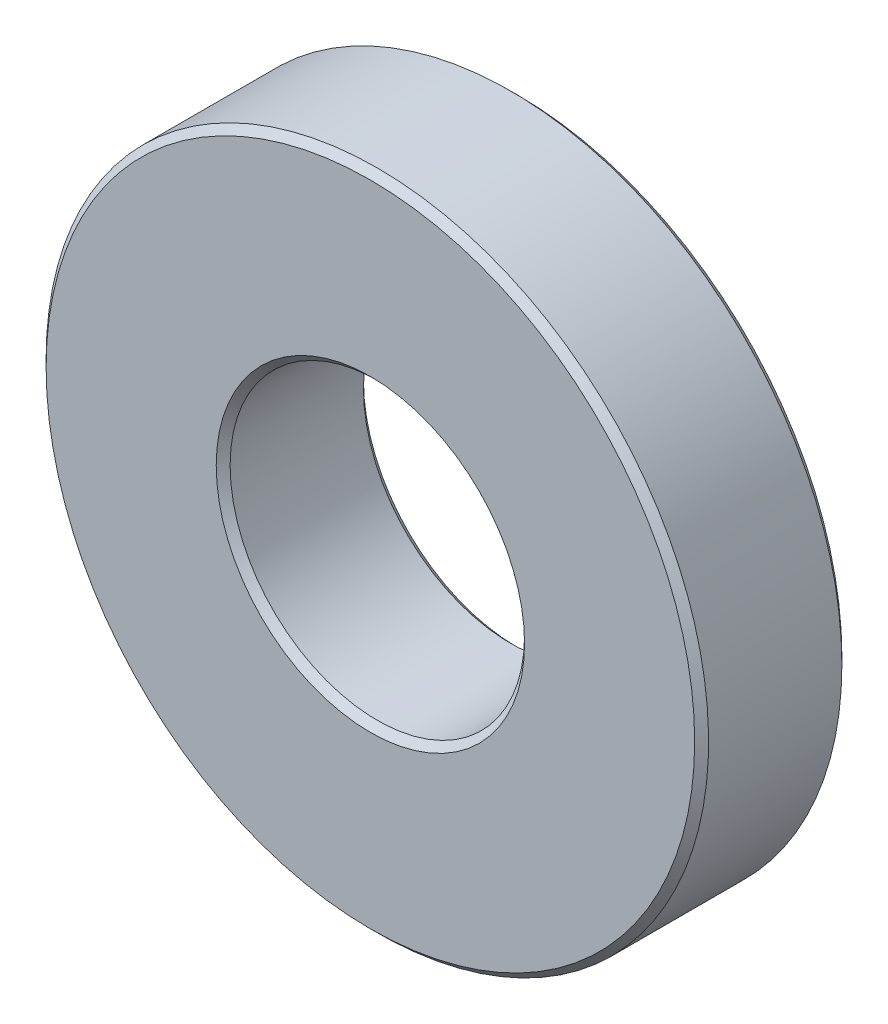
ISO-10303-21;
HEADER;
FILE_DESCRIPTION(('STEP AP214'),'2;1');
FILE_NAME('part.step','',(''),(''),'','','');
FILE_SCHEMA(('AUTOMOTIVE_DESIGN { 1 0 10303 214 1 1 1 1 }'));
ENDSEC;
DATA;
#1=APPLICATION_CONTEXT('core data for automotive mechanical design processes');
#2=APPLICATION_PROTOCOL_DEFINITION('international standard','automotive_design',2000,#1);
#3=PRODUCT_CONTEXT('',#1,'mechanical');
#4=PRODUCT('Part','Part','',(#3));
#5=PRODUCT_RELATED_PRODUCT_CATEGORY('part','',(#4));
#6=PRODUCT_DEFINITION_FORMATION('','',#4);
#7=PRODUCT_DEFINITION_CONTEXT('part definition',#1,'design');
#8=PRODUCT_DEFINITION('design','',#6,#7);
#9=PRODUCT_DEFINITION_SHAPE('','',#8);
#10=(LENGTH_UNIT() NAMED_UNIT(*) SI_UNIT(.MILLI.,.METRE.));
#11=(NAMED_UNIT(*) PLANE_ANGLE_UNIT() SI_UNIT($,.RADIAN.));
#12=(NAMED_UNIT(*) SI_UNIT($,.STERADIAN.) SOLID_ANGLE_UNIT());
#13=UNCERTAINTY_MEASURE_WITH_UNIT(LENGTH_MEASURE(1.E-05),#10,'distance_accuracy_value','');
#14=(GEOMETRIC_REPRESENTATION_CONTEXT(3) GLOBAL_UNCERTAINTY_ASSIGNED_CONTEXT((#13)) GLOBAL_UNIT_ASSIGNED_CONTEXT((#10,
#11,#12)) REPRESENTATION_CONTEXT('',''));
#15=CARTESIAN_POINT('',(0.,0.,0.));
#16=DIRECTION('',(0.,0.,1.));
#17=DIRECTION('',(1.,0.,0.));
#18=AXIS2_PLACEMENT_3D('',#15,#16,#17);
#19=CARTESIAN_POINT('',(0.,0.,6.35));
#20=DIRECTION('',(0.,0.,-1.));
#21=DIRECTION('',(-1.,0.,0.));
#22=AXIS2_PLACEMENT_3D('',#19,#20,#21);
#23=CYLINDRICAL_SURFACE('',#22,6.35);
#24=CARTESIAN_POINT('',(0.,0.,6.04999999995925));
#25=DIRECTION('',(0.,0.,1.));
#26=DIRECTION('',(1.,0.,0.));
#27=AXIS2_PLACEMENT_3D('',#24,#25,#26);
#28=CIRCLE('',#27,6.34999999994079);
#29=CARTESIAN_POINT('',(6.34999999994079,0.,6.04999999995925));
#30=VERTEX_POINT('',#29);
#31=EDGE_CURVE('E33',#30,#30,#28,.T.);
#32=ORIENTED_EDGE('',*,*,#31,.T.);
#33=EDGE_LOOP('',(#32));
#34=FACE_BOUND('',#33,.T.);
#35=CARTESIAN_POINT('',(0.,0.,0.299999999981537));
#36=DIRECTION('',(0.,0.,-1.));
#37=DIRECTION('',(-1.,0.,0.));
#38=AXIS2_PLACEMENT_3D('',#35,#36,#37);
#39=CIRCLE('',#38,6.34999999999764);
#40=CARTESIAN_POINT('',(-6.34999999999764,0.,0.299999999981537));
#41=VERTEX_POINT('',#40);
#42=EDGE_CURVE('E36',#41,#41,#39,.T.);
#43=ORIENTED_EDGE('',*,*,#42,.T.);
#44=EDGE_LOOP('',(#43));
#45=FACE_BOUND('',#44,.T.);
#46=ADVANCED_FACE('F14',(#34,#45),#23,.F.);
#47=CARTESIAN_POINT('',(0.,0.,0.));
#48=DIRECTION('',(0.,0.,-1.));
#49=DIRECTION('',(-1.,0.,0.));
#50=AXIS2_PLACEMENT_3D('',#47,#48,#49);
#51=CONICAL_SURFACE('',#50,6.64999999997918,0.785398163397448);
#52=ORIENTED_EDGE('',*,*,#42,.F.);
#53=EDGE_LOOP('',(#52));
#54=FACE_BOUND('',#53,.T.);
#55=CARTESIAN_POINT('',(0.,0.,0.));
#56=DIRECTION('',(0.,0.,-1.));
#57=DIRECTION('',(-1.,0.,0.));
#58=AXIS2_PLACEMENT_3D('',#55,#56,#57);
#59=CIRCLE('',#58,6.64999999997918);
#60=CARTESIAN_POINT('',(-6.64999999997917,0.,0.));
#61=VERTEX_POINT('',#60);
#62=EDGE_CURVE('E17',#61,#61,#59,.F.);
#63=ORIENTED_EDGE('',*,*,#62,.F.);
#64=EDGE_LOOP('',(#63));
#65=FACE_BOUND('',#64,.T.);
#66=ADVANCED_FACE('F56',(#54,#65),#51,.F.);
#67=CARTESIAN_POINT('',(0.,0.,6.35000000011132));
#68=DIRECTION('',(0.,0.,1.));
#69=DIRECTION('',(1.,0.,0.));
#70=AXIS2_PLACEMENT_3D('',#67,#68,#69);
#71=CONICAL_SURFACE('',#70,6.65000000009286,0.785398163397448);
#72=CARTESIAN_POINT('',(0.,0.,6.35000000005448));
#73=DIRECTION('',(0.,0.,1.));
#74=DIRECTION('',(1.,0.,0.));
#75=AXIS2_PLACEMENT_3D('',#72,#73,#74);
#76=CIRCLE('',#75,6.65000000003601);
#77=CARTESIAN_POINT('',(6.65000000003602,0.,6.35000000005448));
#78=VERTEX_POINT('',#77);
#79=EDGE_CURVE('E47',#78,#78,#76,.T.);
#80=ORIENTED_EDGE('',*,*,#79,.T.);
#81=EDGE_LOOP('',(#80));
#82=FACE_BOUND('',#81,.T.);
#83=ORIENTED_EDGE('',*,*,#31,.F.);
#84=EDGE_LOOP('',(#83));
#85=FACE_BOUND('',#84,.T.);
#86=ADVANCED_FACE('F58',(#82,#85),#71,.F.);
#87=CARTESIAN_POINT('',(0.,0.,0.));
#88=DIRECTION('',(0.,0.,-1.));
#89=DIRECTION('',(-1.,0.,0.));
#90=AXIS2_PLACEMENT_3D('',#87,#88,#89);
#91=PLANE('',#90);
#92=CARTESIAN_POINT('',(0.,0.,0.));
#93=DIRECTION('',(0.,0.,1.));
#94=DIRECTION('',(1.,0.,0.));
#95=AXIS2_PLACEMENT_3D('',#92,#93,#94);
#96=CIRCLE('',#95,13.9875);
#97=CARTESIAN_POINT('',(13.9875,0.,0.));
#98=VERTEX_POINT('',#97);
#99=EDGE_CURVE('E45',#98,#98,#96,.T.);
#100=ORIENTED_EDGE('',*,*,#99,.F.);
#101=EDGE_LOOP('',(#100));
#102=FACE_BOUND('',#101,.T.);
#103=ORIENTED_EDGE('',*,*,#62,.T.);
#104=EDGE_LOOP('',(#103));
#105=FACE_BOUND('',#104,.T.);
#106=ADVANCED_FACE('F54',(#102,#105),#91,.T.);
#107=CARTESIAN_POINT('',(0.,0.,6.35));
#108=DIRECTION('',(0.,0.,-1.));
#109=DIRECTION('',(-1.,0.,0.));
#110=AXIS2_PLACEMENT_3D('',#107,#108,#109);
#111=PLANE('',#110);
#112=ORIENTED_EDGE('',*,*,#79,.F.);
#113=EDGE_LOOP('',(#112));
#114=FACE_BOUND('',#113,.T.);
#115=CARTESIAN_POINT('',(0.,0.,6.35));
#116=DIRECTION('',(0.,0.,-1.));
#117=DIRECTION('',(0.,1.,0.));
#118=AXIS2_PLACEMENT_3D('',#115,#116,#117);
#119=CIRCLE('',#118,13.9875);
#120=CARTESIAN_POINT('',(0.,13.9875,6.35));
#121=VERTEX_POINT('',#120);
#122=EDGE_CURVE('E26',#121,#121,#119,.T.);
#123=ORIENTED_EDGE('',*,*,#122,.F.);
#124=EDGE_LOOP('',(#123));
#125=FACE_BOUND('',#124,.T.);
#126=ADVANCED_FACE('F82',(#114,#125),#111,.F.);
#127=CARTESIAN_POINT('',(0.,0.,0.300000000000002));
#128=DIRECTION('',(0.,0.,1.));
#129=DIRECTION('',(1.,0.,0.));
#130=AXIS2_PLACEMENT_3D('',#127,#128,#129);
#131=CONICAL_SURFACE('',#130,14.2875,0.785398163397448);
#132=ORIENTED_EDGE('',*,*,#99,.T.);
#133=EDGE_LOOP('',(#132));
#134=FACE_BOUND('',#133,.T.);
#135=CARTESIAN_POINT('',(0.,0.,0.3));
#136=DIRECTION('',(0.,0.,-1.));
#137=DIRECTION('',(-1.,0.,0.));
#138=AXIS2_PLACEMENT_3D('',#135,#136,#137);
#139=CIRCLE('',#138,14.2875);
#140=CARTESIAN_POINT('',(-14.2875,0.,0.3));
#141=VERTEX_POINT('',#140);
#142=EDGE_CURVE('E21',#141,#141,#139,.F.);
#143=ORIENTED_EDGE('',*,*,#142,.F.);
#144=EDGE_LOOP('',(#143));
#145=FACE_BOUND('',#144,.T.);
#146=ADVANCED_FACE('F75',(#134,#145),#131,.T.);
#147=CARTESIAN_POINT('',(0.,0.,6.05));
#148=DIRECTION('',(0.,0.,-1.));
#149=DIRECTION('',(0.,1.,0.));
#150=AXIS2_PLACEMENT_3D('',#147,#148,#149);
#151=CONICAL_SURFACE('',#150,14.2875,0.785398163397448);
#152=CARTESIAN_POINT('',(0.,0.,6.05));
#153=DIRECTION('',(0.,0.,-1.));
#154=DIRECTION('',(-1.,0.,0.));
#155=AXIS2_PLACEMENT_3D('',#152,#153,#154);
#156=CIRCLE('',#155,14.2875);
#157=CARTESIAN_POINT('',(-14.2875,0.,6.05));
#158=VERTEX_POINT('',#157);
#159=EDGE_CURVE('E9',#158,#158,#156,.T.);
#160=ORIENTED_EDGE('',*,*,#159,.F.);
#161=EDGE_LOOP('',(#160));
#162=FACE_BOUND('',#161,.T.);
#163=ORIENTED_EDGE('',*,*,#122,.T.);
#164=EDGE_LOOP('',(#163));
#165=FACE_BOUND('',#164,.T.);
#166=ADVANCED_FACE('F70',(#162,#165),#151,.T.);
#167=CARTESIAN_POINT('',(0.,0.,6.35));
#168=DIRECTION('',(0.,0.,-1.));
#169=DIRECTION('',(-1.,0.,0.));
#170=AXIS2_PLACEMENT_3D('',#167,#168,#169);
#171=CYLINDRICAL_SURFACE('',#170,14.2875);
#172=ORIENTED_EDGE('',*,*,#159,.T.);
#173=EDGE_LOOP('',(#172));
#174=FACE_BOUND('',#173,.T.);
#175=ORIENTED_EDGE('',*,*,#142,.T.);
#176=EDGE_LOOP('',(#175));
#177=FACE_BOUND('',#176,.T.);
#178=ADVANCED_FACE('F68',(#174,#177),#171,.T.);
#179=CLOSED_SHELL('',(#46,#66,#86,#106,#126,#146,#166,#178));
#180=MANIFOLD_SOLID_BREP('B1',#179);
#181=ADVANCED_BREP_SHAPE_REPRESENTATION('',(#18,#180),#14);
#182=SHAPE_DEFINITION_REPRESENTATION(#9,#181);
ENDSEC;
END-ISO-10303-21;
